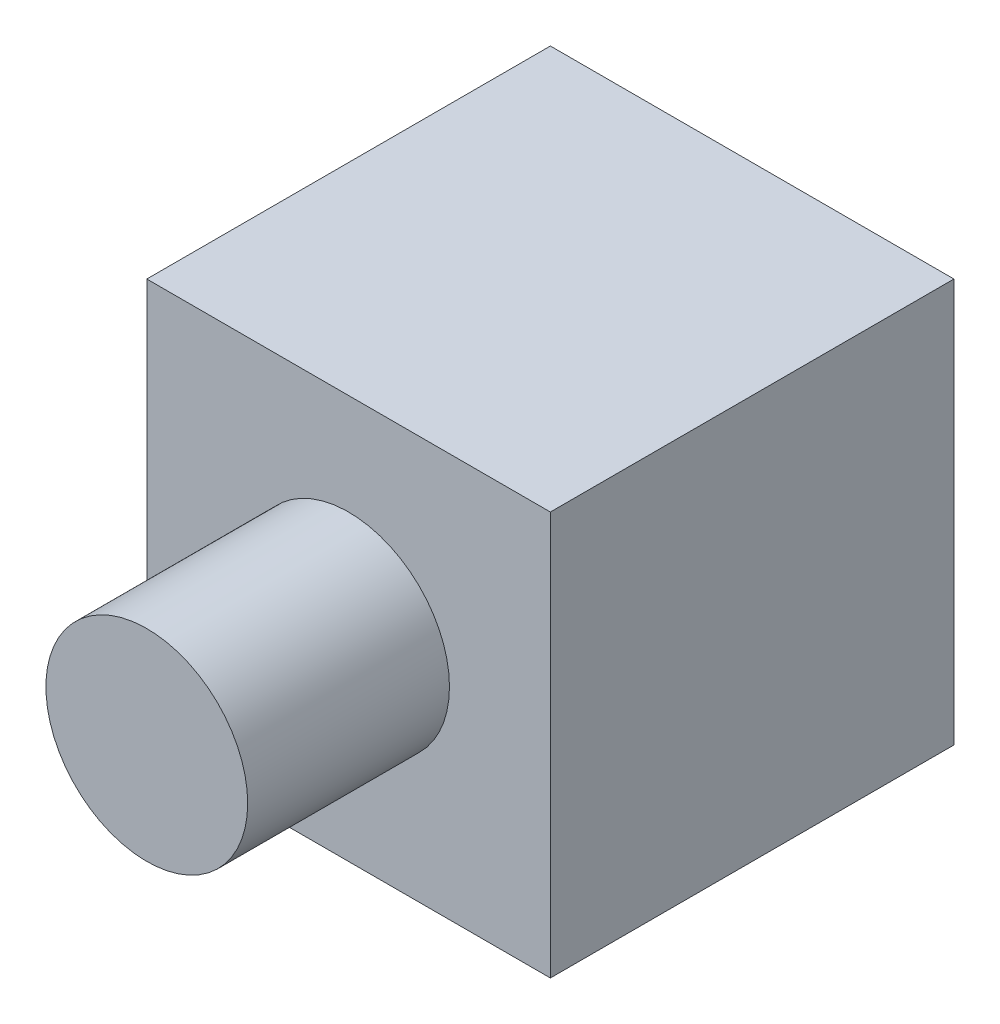
ISO-10303-21;
HEADER;
FILE_DESCRIPTION(('STEP AP214'),'2;1');
FILE_NAME('part.step','',(''),(''),'','','');
FILE_SCHEMA(('AUTOMOTIVE_DESIGN { 1 0 10303 214 1 1 1 1 }'));
ENDSEC;
DATA;
#1=APPLICATION_CONTEXT('core data for automotive mechanical design processes');
#2=APPLICATION_PROTOCOL_DEFINITION('international standard','automotive_design',2000,#1);
#3=PRODUCT_CONTEXT('',#1,'mechanical');
#4=PRODUCT('Part','Part','',(#3));
#5=PRODUCT_RELATED_PRODUCT_CATEGORY('part','',(#4));
#6=PRODUCT_DEFINITION_FORMATION('','',#4);
#7=PRODUCT_DEFINITION_CONTEXT('part definition',#1,'design');
#8=PRODUCT_DEFINITION('design','',#6,#7);
#9=PRODUCT_DEFINITION_SHAPE('','',#8);
#10=(LENGTH_UNIT() NAMED_UNIT(*) SI_UNIT(.MILLI.,.METRE.));
#11=(NAMED_UNIT(*) PLANE_ANGLE_UNIT() SI_UNIT($,.RADIAN.));
#12=(NAMED_UNIT(*) SI_UNIT($,.STERADIAN.) SOLID_ANGLE_UNIT());
#13=UNCERTAINTY_MEASURE_WITH_UNIT(LENGTH_MEASURE(1.E-05),#10,'distance_accuracy_value','');
#14=(GEOMETRIC_REPRESENTATION_CONTEXT(3) GLOBAL_UNCERTAINTY_ASSIGNED_CONTEXT((#13)) GLOBAL_UNIT_ASSIGNED_CONTEXT((#10,
#11,#12)) REPRESENTATION_CONTEXT('',''));
#15=CARTESIAN_POINT('',(0.,0.,0.));
#16=DIRECTION('',(0.,0.,1.));
#17=DIRECTION('',(1.,0.,0.));
#18=AXIS2_PLACEMENT_3D('',#15,#16,#17);
#19=CARTESIAN_POINT('',(50.,50.,-50.));
#20=DIRECTION('',(1.,0.,0.));
#21=DIRECTION('',(0.,1.,0.));
#22=AXIS2_PLACEMENT_3D('',#19,#20,#21);
#23=PLANE('',#22);
#24=DIRECTION('',(0.,0.,1.));
#25=VECTOR('',#24,1.);
#26=CARTESIAN_POINT('',(50.,50.,-50.));
#27=LINE('',#26,#25);
#28=CARTESIAN_POINT('',(50.,50.,-50.));
#29=VERTEX_POINT('',#28);
#30=CARTESIAN_POINT('',(50.,50.,50.));
#31=VERTEX_POINT('',#30);
#32=EDGE_CURVE('E70',#29,#31,#27,.T.);
#33=ORIENTED_EDGE('',*,*,#32,.T.);
#34=DIRECTION('',(0.,1.,0.));
#35=VECTOR('',#34,1.);
#36=CARTESIAN_POINT('',(50.,50.,50.));
#37=LINE('',#36,#35);
#38=CARTESIAN_POINT('',(50.,-50.,50.));
#39=VERTEX_POINT('',#38);
#40=EDGE_CURVE('E73',#39,#31,#37,.T.);
#41=ORIENTED_EDGE('',*,*,#40,.F.);
#42=DIRECTION('',(0.,0.,1.));
#43=VECTOR('',#42,1.);
#44=CARTESIAN_POINT('',(50.,-50.,-50.));
#45=LINE('',#44,#43);
#46=CARTESIAN_POINT('',(50.,-50.,-50.));
#47=VERTEX_POINT('',#46);
#48=EDGE_CURVE('E39',#47,#39,#45,.T.);
#49=ORIENTED_EDGE('',*,*,#48,.F.);
#50=DIRECTION('',(0.,1.,0.));
#51=VECTOR('',#50,1.);
#52=CARTESIAN_POINT('',(50.,50.,-50.));
#53=LINE('',#52,#51);
#54=EDGE_CURVE('E74',#47,#29,#53,.T.);
#55=ORIENTED_EDGE('',*,*,#54,.T.);
#56=EDGE_LOOP('',(#33,#41,#49,#55));
#57=FACE_BOUND('',#56,.T.);
#58=ADVANCED_FACE('F32',(#57),#23,.T.);
#59=CARTESIAN_POINT('',(-50.,-50.,-50.));
#60=DIRECTION('',(0.,-1.,0.));
#61=DIRECTION('',(0.,0.,-1.));
#62=AXIS2_PLACEMENT_3D('',#59,#60,#61);
#63=PLANE('',#62);
#64=ORIENTED_EDGE('',*,*,#48,.T.);
#65=DIRECTION('',(1.,0.,0.));
#66=VECTOR('',#65,1.);
#67=CARTESIAN_POINT('',(-50.,-50.,50.));
#68=LINE('',#67,#66);
#69=CARTESIAN_POINT('',(-50.,-50.,50.));
#70=VERTEX_POINT('',#69);
#71=EDGE_CURVE('E90',#70,#39,#68,.T.);
#72=ORIENTED_EDGE('',*,*,#71,.F.);
#73=DIRECTION('',(0.,0.,1.));
#74=VECTOR('',#73,1.);
#75=CARTESIAN_POINT('',(-50.,-50.,-50.));
#76=LINE('',#75,#74);
#77=CARTESIAN_POINT('',(-50.,-50.,-50.));
#78=VERTEX_POINT('',#77);
#79=EDGE_CURVE('E53',#78,#70,#76,.T.);
#80=ORIENTED_EDGE('',*,*,#79,.F.);
#81=DIRECTION('',(1.,0.,0.));
#82=VECTOR('',#81,1.);
#83=CARTESIAN_POINT('',(-50.,-50.,-50.));
#84=LINE('',#83,#82);
#85=EDGE_CURVE('E79',#78,#47,#84,.T.);
#86=ORIENTED_EDGE('',*,*,#85,.T.);
#87=EDGE_LOOP('',(#64,#72,#80,#86));
#88=FACE_BOUND('',#87,.T.);
#89=ADVANCED_FACE('F110',(#88),#63,.T.);
#90=CARTESIAN_POINT('',(-50.,50.,-50.));
#91=DIRECTION('',(-1.,0.,0.));
#92=DIRECTION('',(0.,-1.,0.));
#93=AXIS2_PLACEMENT_3D('',#90,#91,#92);
#94=PLANE('',#93);
#95=ORIENTED_EDGE('',*,*,#79,.T.);
#96=DIRECTION('',(0.,-1.,0.));
#97=VECTOR('',#96,1.);
#98=CARTESIAN_POINT('',(-50.,50.,50.));
#99=LINE('',#98,#97);
#100=CARTESIAN_POINT('',(-50.,50.,50.));
#101=VERTEX_POINT('',#100);
#102=EDGE_CURVE('E86',#101,#70,#99,.T.);
#103=ORIENTED_EDGE('',*,*,#102,.F.);
#104=DIRECTION('',(0.,0.,1.));
#105=VECTOR('',#104,1.);
#106=CARTESIAN_POINT('',(-50.,50.,-50.));
#107=LINE('',#106,#105);
#108=CARTESIAN_POINT('',(-50.,50.,-50.));
#109=VERTEX_POINT('',#108);
#110=EDGE_CURVE('E78',#109,#101,#107,.T.);
#111=ORIENTED_EDGE('',*,*,#110,.F.);
#112=DIRECTION('',(0.,-1.,0.));
#113=VECTOR('',#112,1.);
#114=CARTESIAN_POINT('',(-50.,50.,-50.));
#115=LINE('',#114,#113);
#116=EDGE_CURVE('E101',#109,#78,#115,.T.);
#117=ORIENTED_EDGE('',*,*,#116,.T.);
#118=EDGE_LOOP('',(#95,#103,#111,#117));
#119=FACE_BOUND('',#118,.T.);
#120=ADVANCED_FACE('F107',(#119),#94,.T.);
#121=CARTESIAN_POINT('',(-50.,50.,-50.));
#122=DIRECTION('',(0.,1.,0.));
#123=DIRECTION('',(0.,0.,1.));
#124=AXIS2_PLACEMENT_3D('',#121,#122,#123);
#125=PLANE('',#124);
#126=ORIENTED_EDGE('',*,*,#110,.T.);
#127=DIRECTION('',(-1.,0.,0.));
#128=VECTOR('',#127,1.);
#129=CARTESIAN_POINT('',(-50.,50.,50.));
#130=LINE('',#129,#128);
#131=EDGE_CURVE('E81',#31,#101,#130,.T.);
#132=ORIENTED_EDGE('',*,*,#131,.F.);
#133=ORIENTED_EDGE('',*,*,#32,.F.);
#134=DIRECTION('',(-1.,0.,0.));
#135=VECTOR('',#134,1.);
#136=CARTESIAN_POINT('',(-50.,50.,-50.));
#137=LINE('',#136,#135);
#138=EDGE_CURVE('E99',#29,#109,#137,.T.);
#139=ORIENTED_EDGE('',*,*,#138,.T.);
#140=EDGE_LOOP('',(#126,#132,#133,#139));
#141=FACE_BOUND('',#140,.T.);
#142=ADVANCED_FACE('F82',(#141),#125,.T.);
#143=CARTESIAN_POINT('',(0.,0.,-50.));
#144=DIRECTION('',(0.,0.,1.));
#145=DIRECTION('',(1.,0.,0.));
#146=AXIS2_PLACEMENT_3D('',#143,#144,#145);
#147=PLANE('',#146);
#148=ORIENTED_EDGE('',*,*,#54,.F.);
#149=ORIENTED_EDGE('',*,*,#85,.F.);
#150=ORIENTED_EDGE('',*,*,#116,.F.);
#151=ORIENTED_EDGE('',*,*,#138,.F.);
#152=EDGE_LOOP('',(#148,#149,#150,#151));
#153=FACE_BOUND('',#152,.T.);
#154=ADVANCED_FACE('F112',(#153),#147,.F.);
#155=CARTESIAN_POINT('',(0.,0.,50.));
#156=DIRECTION('',(0.,0.,1.));
#157=DIRECTION('',(1.,0.,0.));
#158=AXIS2_PLACEMENT_3D('',#155,#156,#157);
#159=PLANE('',#158);
#160=CARTESIAN_POINT('',(0.,0.,50.));
#161=DIRECTION('',(0.,0.,1.));
#162=DIRECTION('',(1.,0.,0.));
#163=AXIS2_PLACEMENT_3D('',#160,#161,#162);
#164=CIRCLE('',#163,25.);
#165=CARTESIAN_POINT('',(25.,0.,50.));
#166=VERTEX_POINT('',#165);
#167=EDGE_CURVE('E11',#166,#166,#164,.T.);
#168=ORIENTED_EDGE('',*,*,#167,.F.);
#169=EDGE_LOOP('',(#168));
#170=FACE_BOUND('',#169,.T.);
#171=ORIENTED_EDGE('',*,*,#40,.T.);
#172=ORIENTED_EDGE('',*,*,#131,.T.);
#173=ORIENTED_EDGE('',*,*,#102,.T.);
#174=ORIENTED_EDGE('',*,*,#71,.T.);
#175=EDGE_LOOP('',(#171,#172,#173,#174));
#176=FACE_BOUND('',#175,.T.);
#177=ADVANCED_FACE('F89',(#170,#176),#159,.T.);
#178=CARTESIAN_POINT('',(0.,0.,40.0000000000001));
#179=DIRECTION('',(0.,0.,1.));
#180=DIRECTION('',(1.,0.,0.));
#181=AXIS2_PLACEMENT_3D('',#178,#179,#180);
#182=CYLINDRICAL_SURFACE('',#181,25.);
#183=ORIENTED_EDGE('',*,*,#167,.T.);
#184=EDGE_LOOP('',(#183));
#185=FACE_BOUND('',#184,.T.);
#186=CARTESIAN_POINT('',(0.,0.,100.));
#187=DIRECTION('',(0.,0.,1.));
#188=DIRECTION('',(1.,0.,0.));
#189=AXIS2_PLACEMENT_3D('',#186,#187,#188);
#190=CIRCLE('',#189,25.);
#191=CARTESIAN_POINT('',(25.,0.,100.));
#192=VERTEX_POINT('',#191);
#193=EDGE_CURVE('E91',#192,#192,#190,.T.);
#194=ORIENTED_EDGE('',*,*,#193,.F.);
#195=EDGE_LOOP('',(#194));
#196=FACE_BOUND('',#195,.T.);
#197=ADVANCED_FACE('F119',(#185,#196),#182,.T.);
#198=CARTESIAN_POINT('',(0.,0.,100.));
#199=DIRECTION('',(0.,0.,1.));
#200=DIRECTION('',(1.,0.,0.));
#201=AXIS2_PLACEMENT_3D('',#198,#199,#200);
#202=PLANE('',#201);
#203=ORIENTED_EDGE('',*,*,#193,.T.);
#204=EDGE_LOOP('',(#203));
#205=FACE_BOUND('',#204,.T.);
#206=ADVANCED_FACE('F156',(#205),#202,.T.);
#207=CLOSED_SHELL('',(#58,#89,#120,#142,#154,#177,#197,#206));
#208=MANIFOLD_SOLID_BREP('B2',#207);
#209=ADVANCED_BREP_SHAPE_REPRESENTATION('',(#18,#208),#14);
#210=SHAPE_DEFINITION_REPRESENTATION(#9,#209);
ENDSEC;
END-ISO-10303-21;
